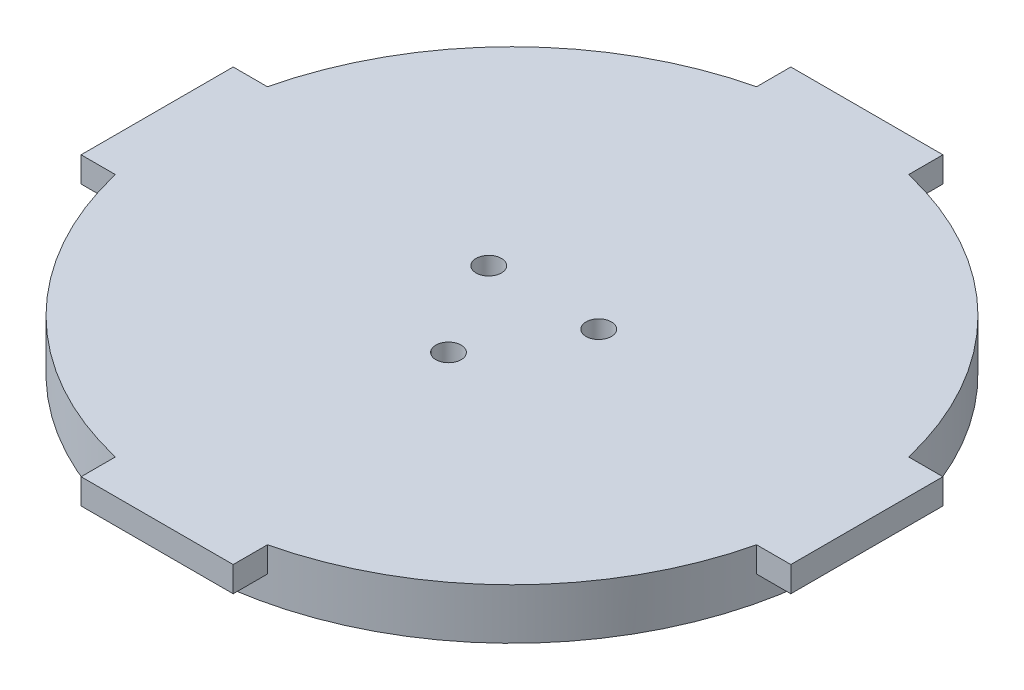
ISO-10303-21;
HEADER;
FILE_DESCRIPTION(('STEP AP214'),'2;1');
FILE_NAME('part.step','',(''),(''),'','','');
FILE_SCHEMA(('AUTOMOTIVE_DESIGN { 1 0 10303 214 1 1 1 1 }'));
ENDSEC;
DATA;
#1=APPLICATION_CONTEXT('core data for automotive mechanical design processes');
#2=APPLICATION_PROTOCOL_DEFINITION('international standard','automotive_design',2000,#1);
#3=PRODUCT_CONTEXT('',#1,'mechanical');
#4=PRODUCT('Part','Part','',(#3));
#5=PRODUCT_RELATED_PRODUCT_CATEGORY('part','',(#4));
#6=PRODUCT_DEFINITION_FORMATION('','',#4);
#7=PRODUCT_DEFINITION_CONTEXT('part definition',#1,'design');
#8=PRODUCT_DEFINITION('design','',#6,#7);
#9=PRODUCT_DEFINITION_SHAPE('','',#8);
#10=(LENGTH_UNIT() NAMED_UNIT(*) SI_UNIT(.MILLI.,.METRE.));
#11=(NAMED_UNIT(*) PLANE_ANGLE_UNIT() SI_UNIT($,.RADIAN.));
#12=(NAMED_UNIT(*) SI_UNIT($,.STERADIAN.) SOLID_ANGLE_UNIT());
#13=UNCERTAINTY_MEASURE_WITH_UNIT(LENGTH_MEASURE(1.E-05),#10,'distance_accuracy_value','');
#14=(GEOMETRIC_REPRESENTATION_CONTEXT(3) GLOBAL_UNCERTAINTY_ASSIGNED_CONTEXT((#13)) GLOBAL_UNIT_ASSIGNED_CONTEXT((#10,
#11,#12)) REPRESENTATION_CONTEXT('',''));
#15=CARTESIAN_POINT('',(0.,0.,0.));
#16=DIRECTION('',(0.,0.,1.));
#17=DIRECTION('',(1.,0.,0.));
#18=AXIS2_PLACEMENT_3D('',#15,#16,#17);
#19=CARTESIAN_POINT('',(0.,-141.847763108502,0.));
#20=DIRECTION('',(0.,1.,0.));
#21=DIRECTION('',(0.,0.,1.));
#22=AXIS2_PLACEMENT_3D('',#19,#20,#21);
#23=CYLINDRICAL_SURFACE('',#22,65.);
#24=DIRECTION('',(0.,-1.,0.));
#25=VECTOR('',#24,1.);
#26=CARTESIAN_POINT('',(-15.,70.,63.2455532033676));
#27=LINE('',#26,#25);
#28=CARTESIAN_POINT('',(-15.,70.,63.2455532033676));
#29=VERTEX_POINT('',#28);
#30=CARTESIAN_POINT('',(-15.,65.,63.2455532033676));
#31=VERTEX_POINT('',#30);
#32=EDGE_CURVE('E198',#29,#31,#27,.T.);
#33=ORIENTED_EDGE('',*,*,#32,.F.);
#34=CARTESIAN_POINT('',(0.,70.,0.));
#35=DIRECTION('',(0.,1.,0.));
#36=DIRECTION('',(0.,0.,1.));
#37=AXIS2_PLACEMENT_3D('',#34,#35,#36);
#38=CIRCLE('',#37,65.);
#39=CARTESIAN_POINT('',(-63.2455532033676,70.,15.));
#40=VERTEX_POINT('',#39);
#41=EDGE_CURVE('E213',#40,#29,#38,.T.);
#42=ORIENTED_EDGE('',*,*,#41,.F.);
#43=DIRECTION('',(0.,-1.,0.));
#44=VECTOR('',#43,1.);
#45=CARTESIAN_POINT('',(-63.2455532033676,70.,15.));
#46=LINE('',#45,#44);
#47=CARTESIAN_POINT('',(-63.2455532033676,65.,15.));
#48=VERTEX_POINT('',#47);
#49=EDGE_CURVE('E71',#40,#48,#46,.T.);
#50=ORIENTED_EDGE('',*,*,#49,.T.);
#51=CARTESIAN_POINT('',(0.,65.,0.));
#52=DIRECTION('',(0.,1.,0.));
#53=DIRECTION('',(0.,0.,1.));
#54=AXIS2_PLACEMENT_3D('',#51,#52,#53);
#55=CIRCLE('',#54,65.);
#56=CARTESIAN_POINT('',(-63.2455532033676,65.,-15.));
#57=VERTEX_POINT('',#56);
#58=EDGE_CURVE('E290',#57,#48,#55,.T.);
#59=ORIENTED_EDGE('',*,*,#58,.F.);
#60=DIRECTION('',(0.,-1.,0.));
#61=VECTOR('',#60,1.);
#62=CARTESIAN_POINT('',(-63.2455532033676,70.,-15.));
#63=LINE('',#62,#61);
#64=CARTESIAN_POINT('',(-63.2455532033676,70.,-15.));
#65=VERTEX_POINT('',#64);
#66=EDGE_CURVE('E312',#65,#57,#63,.T.);
#67=ORIENTED_EDGE('',*,*,#66,.F.);
#68=CARTESIAN_POINT('',(-15.,70.,-63.2455532033676));
#69=VERTEX_POINT('',#68);
#70=EDGE_CURVE('E225',#69,#65,#38,.T.);
#71=ORIENTED_EDGE('',*,*,#70,.F.);
#72=DIRECTION('',(0.,-1.,0.));
#73=VECTOR('',#72,1.);
#74=CARTESIAN_POINT('',(-15.,70.,-63.2455532033676));
#75=LINE('',#74,#73);
#76=CARTESIAN_POINT('',(-15.,65.,-63.2455532033676));
#77=VERTEX_POINT('',#76);
#78=EDGE_CURVE('E79',#69,#77,#75,.T.);
#79=ORIENTED_EDGE('',*,*,#78,.T.);
#80=CARTESIAN_POINT('',(0.,65.,0.));
#81=DIRECTION('',(0.,1.,0.));
#82=DIRECTION('',(0.,0.,1.));
#83=AXIS2_PLACEMENT_3D('',#80,#81,#82);
#84=CIRCLE('',#83,65.);
#85=CARTESIAN_POINT('',(15.,65.,-63.2455532033676));
#86=VERTEX_POINT('',#85);
#87=EDGE_CURVE('E263',#86,#77,#84,.T.);
#88=ORIENTED_EDGE('',*,*,#87,.F.);
#89=DIRECTION('',(0.,-1.,0.));
#90=VECTOR('',#89,1.);
#91=CARTESIAN_POINT('',(15.,70.,-63.2455532033676));
#92=LINE('',#91,#90);
#93=CARTESIAN_POINT('',(15.,70.,-63.2455532033676));
#94=VERTEX_POINT('',#93);
#95=EDGE_CURVE('E261',#94,#86,#92,.T.);
#96=ORIENTED_EDGE('',*,*,#95,.F.);
#97=CARTESIAN_POINT('',(63.2455532033676,70.,-15.));
#98=VERTEX_POINT('',#97);
#99=EDGE_CURVE('E232',#98,#94,#38,.T.);
#100=ORIENTED_EDGE('',*,*,#99,.F.);
#101=DIRECTION('',(0.,-1.,0.));
#102=VECTOR('',#101,1.);
#103=CARTESIAN_POINT('',(63.2455532033676,70.,-15.));
#104=LINE('',#103,#102);
#105=CARTESIAN_POINT('',(63.2455532033676,65.,-15.));
#106=VERTEX_POINT('',#105);
#107=EDGE_CURVE('E259',#98,#106,#104,.T.);
#108=ORIENTED_EDGE('',*,*,#107,.T.);
#109=CARTESIAN_POINT('',(0.,65.,0.));
#110=DIRECTION('',(0.,1.,0.));
#111=DIRECTION('',(0.,0.,1.));
#112=AXIS2_PLACEMENT_3D('',#109,#110,#111);
#113=CIRCLE('',#112,65.);
#114=CARTESIAN_POINT('',(63.2455532033676,65.,15.));
#115=VERTEX_POINT('',#114);
#116=EDGE_CURVE('E279',#115,#106,#113,.T.);
#117=ORIENTED_EDGE('',*,*,#116,.F.);
#118=DIRECTION('',(0.,-1.,0.));
#119=VECTOR('',#118,1.);
#120=CARTESIAN_POINT('',(63.2455532033676,70.,15.));
#121=LINE('',#120,#119);
#122=CARTESIAN_POINT('',(63.2455532033676,70.,15.));
#123=VERTEX_POINT('',#122);
#124=EDGE_CURVE('E522',#123,#115,#121,.T.);
#125=ORIENTED_EDGE('',*,*,#124,.F.);
#126=CARTESIAN_POINT('',(15.,70.,63.2455532033676));
#127=VERTEX_POINT('',#126);
#128=EDGE_CURVE('E228',#127,#123,#38,.T.);
#129=ORIENTED_EDGE('',*,*,#128,.F.);
#130=DIRECTION('',(0.,-1.,0.));
#131=VECTOR('',#130,1.);
#132=CARTESIAN_POINT('',(15.,70.,63.2455532033676));
#133=LINE('',#132,#131);
#134=CARTESIAN_POINT('',(15.,65.,63.2455532033676));
#135=VERTEX_POINT('',#134);
#136=EDGE_CURVE('E524',#127,#135,#133,.T.);
#137=ORIENTED_EDGE('',*,*,#136,.T.);
#138=CARTESIAN_POINT('',(0.,65.,0.));
#139=DIRECTION('',(0.,1.,0.));
#140=DIRECTION('',(0.,0.,1.));
#141=AXIS2_PLACEMENT_3D('',#138,#139,#140);
#142=CIRCLE('',#141,65.);
#143=EDGE_CURVE('E216',#31,#135,#142,.T.);
#144=ORIENTED_EDGE('',*,*,#143,.F.);
#145=EDGE_LOOP('',(#33,#42,#50,#59,#67,#71,#79,#88,#96,#100,#108,#117,#125,#129,#137,#144));
#146=FACE_BOUND('',#145,.T.);
#147=CARTESIAN_POINT('',(0.,60.,0.));
#148=DIRECTION('',(0.,1.,0.));
#149=DIRECTION('',(0.,0.,1.));
#150=AXIS2_PLACEMENT_3D('',#147,#148,#149);
#151=CIRCLE('',#150,65.);
#152=CARTESIAN_POINT('',(0.,60.,65.));
#153=VERTEX_POINT('',#152);
#154=EDGE_CURVE('E226',#153,#153,#151,.T.);
#155=ORIENTED_EDGE('',*,*,#154,.T.);
#156=EDGE_LOOP('',(#155));
#157=FACE_BOUND('',#156,.T.);
#158=ADVANCED_FACE('F55',(#146,#157),#23,.T.);
#159=CARTESIAN_POINT('',(0.,70.,0.));
#160=DIRECTION('',(0.,1.,0.));
#161=DIRECTION('',(0.,0.,1.));
#162=AXIS2_PLACEMENT_3D('',#159,#160,#161);
#163=PLANE('',#162);
#164=CARTESIAN_POINT('',(0.,70.,12.525));
#165=DIRECTION('',(0.,-1.,0.));
#166=DIRECTION('',(-0.866025403784436,0.,0.500000000000004));
#167=AXIS2_PLACEMENT_3D('',#164,#165,#166);
#168=CIRCLE('',#167,2.5);
#169=CARTESIAN_POINT('',(0.,70.,10.025));
#170=VERTEX_POINT('',#169);
#171=EDGE_CURVE('E316',#170,#170,#168,.T.);
#172=ORIENTED_EDGE('',*,*,#171,.T.);
#173=EDGE_LOOP('',(#172));
#174=FACE_BOUND('',#173,.T.);
#175=CARTESIAN_POINT('',(10.8469681824001,70.,-6.26250000000005));
#176=DIRECTION('',(0.,-1.,0.));
#177=DIRECTION('',(0.866025403784443,0.,0.499999999999992));
#178=AXIS2_PLACEMENT_3D('',#175,#176,#177);
#179=CIRCLE('',#178,2.5);
#180=CARTESIAN_POINT('',(10.8469681824001,70.,-8.76250000000005));
#181=VERTEX_POINT('',#180);
#182=EDGE_CURVE('E218',#181,#181,#179,.T.);
#183=ORIENTED_EDGE('',*,*,#182,.T.);
#184=EDGE_LOOP('',(#183));
#185=FACE_BOUND('',#184,.T.);
#186=CARTESIAN_POINT('',(-10.8469681824001,70.,-6.26250000000005));
#187=DIRECTION('',(0.,-1.,0.));
#188=DIRECTION('',(0.,0.,-1.));
#189=AXIS2_PLACEMENT_3D('',#186,#187,#188);
#190=CIRCLE('',#189,2.5);
#191=CARTESIAN_POINT('',(-10.8469681824001,70.,-8.76250000000004));
#192=VERTEX_POINT('',#191);
#193=EDGE_CURVE('E331',#192,#192,#190,.T.);
#194=ORIENTED_EDGE('',*,*,#193,.T.);
#195=EDGE_LOOP('',(#194));
#196=FACE_BOUND('',#195,.T.);
#197=ORIENTED_EDGE('',*,*,#128,.T.);
#198=DIRECTION('',(-1.,0.,0.));
#199=VECTOR('',#198,1.);
#200=CARTESIAN_POINT('',(0.,70.,15.));
#201=LINE('',#200,#199);
#202=CARTESIAN_POINT('',(70.,70.,15.));
#203=VERTEX_POINT('',#202);
#204=EDGE_CURVE('E540',#203,#123,#201,.T.);
#205=ORIENTED_EDGE('',*,*,#204,.F.);
#206=DIRECTION('',(0.,0.,1.));
#207=VECTOR('',#206,1.);
#208=CARTESIAN_POINT('',(70.,70.,0.));
#209=LINE('',#208,#207);
#210=CARTESIAN_POINT('',(70.,70.,-15.));
#211=VERTEX_POINT('',#210);
#212=EDGE_CURVE('E543',#211,#203,#209,.T.);
#213=ORIENTED_EDGE('',*,*,#212,.F.);
#214=DIRECTION('',(-1.,0.,0.));
#215=VECTOR('',#214,1.);
#216=CARTESIAN_POINT('',(0.,70.,-15.));
#217=LINE('',#216,#215);
#218=EDGE_CURVE('E255',#211,#98,#217,.T.);
#219=ORIENTED_EDGE('',*,*,#218,.T.);
#220=ORIENTED_EDGE('',*,*,#99,.T.);
#221=DIRECTION('',(0.,0.,1.));
#222=VECTOR('',#221,1.);
#223=CARTESIAN_POINT('',(15.,70.,0.));
#224=LINE('',#223,#222);
#225=CARTESIAN_POINT('',(15.,70.,-70.));
#226=VERTEX_POINT('',#225);
#227=EDGE_CURVE('E252',#226,#94,#224,.T.);
#228=ORIENTED_EDGE('',*,*,#227,.F.);
#229=DIRECTION('',(1.,0.,0.));
#230=VECTOR('',#229,1.);
#231=CARTESIAN_POINT('',(0.,70.,-70.));
#232=LINE('',#231,#230);
#233=CARTESIAN_POINT('',(-15.,70.,-70.));
#234=VERTEX_POINT('',#233);
#235=EDGE_CURVE('E573',#234,#226,#232,.T.);
#236=ORIENTED_EDGE('',*,*,#235,.F.);
#237=DIRECTION('',(0.,0.,1.));
#238=VECTOR('',#237,1.);
#239=CARTESIAN_POINT('',(-15.,70.,0.));
#240=LINE('',#239,#238);
#241=EDGE_CURVE('E577',#234,#69,#240,.T.);
#242=ORIENTED_EDGE('',*,*,#241,.T.);
#243=ORIENTED_EDGE('',*,*,#70,.T.);
#244=DIRECTION('',(1.,0.,0.));
#245=VECTOR('',#244,1.);
#246=CARTESIAN_POINT('',(0.,70.,-15.));
#247=LINE('',#246,#245);
#248=CARTESIAN_POINT('',(-70.,70.,-15.));
#249=VERTEX_POINT('',#248);
#250=EDGE_CURVE('E280',#249,#65,#247,.T.);
#251=ORIENTED_EDGE('',*,*,#250,.F.);
#252=DIRECTION('',(0.,0.,-1.));
#253=VECTOR('',#252,1.);
#254=CARTESIAN_POINT('',(-70.,70.,0.));
#255=LINE('',#254,#253);
#256=CARTESIAN_POINT('',(-70.,70.,15.));
#257=VERTEX_POINT('',#256);
#258=EDGE_CURVE('E283',#257,#249,#255,.T.);
#259=ORIENTED_EDGE('',*,*,#258,.F.);
#260=DIRECTION('',(1.,0.,0.));
#261=VECTOR('',#260,1.);
#262=CARTESIAN_POINT('',(0.,70.,15.));
#263=LINE('',#262,#261);
#264=EDGE_CURVE('E223',#257,#40,#263,.T.);
#265=ORIENTED_EDGE('',*,*,#264,.T.);
#266=ORIENTED_EDGE('',*,*,#41,.T.);
#267=DIRECTION('',(0.,0.,-1.));
#268=VECTOR('',#267,1.);
#269=CARTESIAN_POINT('',(-15.,70.,0.));
#270=LINE('',#269,#268);
#271=CARTESIAN_POINT('',(-15.,70.,70.));
#272=VERTEX_POINT('',#271);
#273=EDGE_CURVE('E194',#272,#29,#270,.T.);
#274=ORIENTED_EDGE('',*,*,#273,.F.);
#275=DIRECTION('',(-1.,0.,0.));
#276=VECTOR('',#275,1.);
#277=CARTESIAN_POINT('',(0.,70.,70.));
#278=LINE('',#277,#276);
#279=CARTESIAN_POINT('',(15.,70.,70.));
#280=VERTEX_POINT('',#279);
#281=EDGE_CURVE('E206',#280,#272,#278,.T.);
#282=ORIENTED_EDGE('',*,*,#281,.F.);
#283=DIRECTION('',(0.,0.,-1.));
#284=VECTOR('',#283,1.);
#285=CARTESIAN_POINT('',(15.,70.,0.));
#286=LINE('',#285,#284);
#287=EDGE_CURVE('E529',#280,#127,#286,.T.);
#288=ORIENTED_EDGE('',*,*,#287,.T.);
#289=EDGE_LOOP('',(#197,#205,#213,#219,#220,#228,#236,#242,#243,#251,#259,#265,#266,#274,#282,#288));
#290=FACE_BOUND('',#289,.T.);
#291=ADVANCED_FACE('F221',(#174,#185,#196,#290),#163,.T.);
#292=CARTESIAN_POINT('',(0.,45.,0.));
#293=DIRECTION('',(0.,1.,0.));
#294=DIRECTION('',(0.,0.,1.));
#295=AXIS2_PLACEMENT_3D('',#292,#293,#294);
#296=PLANE('',#295);
#297=CARTESIAN_POINT('',(-10.8469681824001,45.,-6.26250000000005));
#298=DIRECTION('',(0.,1.,0.));
#299=DIRECTION('',(0.,0.,1.));
#300=AXIS2_PLACEMENT_3D('',#297,#298,#299);
#301=CIRCLE('',#300,2.5);
#302=CARTESIAN_POINT('',(-10.8469681824001,45.,-8.76250000000004));
#303=VERTEX_POINT('',#302);
#304=EDGE_CURVE('E234',#303,#303,#301,.T.);
#305=ORIENTED_EDGE('',*,*,#304,.T.);
#306=EDGE_LOOP('',(#305));
#307=FACE_BOUND('',#306,.T.);
#308=CARTESIAN_POINT('',(0.,45.,0.));
#309=DIRECTION('',(0.,1.,0.));
#310=DIRECTION('',(0.,0.,1.));
#311=AXIS2_PLACEMENT_3D('',#308,#309,#310);
#312=CIRCLE('',#311,6.);
#313=CARTESIAN_POINT('',(-2.,45.,-5.65685424949238));
#314=VERTEX_POINT('',#313);
#315=CARTESIAN_POINT('',(2.,45.,-5.65685424949238));
#316=VERTEX_POINT('',#315);
#317=EDGE_CURVE('E238',#314,#316,#312,.T.);
#318=ORIENTED_EDGE('',*,*,#317,.T.);
#319=DIRECTION('',(0.,0.,1.));
#320=VECTOR('',#319,1.);
#321=CARTESIAN_POINT('',(2.,45.,0.));
#322=LINE('',#321,#320);
#323=CARTESIAN_POINT('',(2.,45.,-8.));
#324=VERTEX_POINT('',#323);
#325=EDGE_CURVE('E407',#324,#316,#322,.T.);
#326=ORIENTED_EDGE('',*,*,#325,.F.);
#327=DIRECTION('',(1.,0.,0.));
#328=VECTOR('',#327,1.);
#329=CARTESIAN_POINT('',(0.,45.,-8.));
#330=LINE('',#329,#328);
#331=CARTESIAN_POINT('',(-2.,45.,-8.));
#332=VERTEX_POINT('',#331);
#333=EDGE_CURVE('E410',#332,#324,#330,.T.);
#334=ORIENTED_EDGE('',*,*,#333,.F.);
#335=DIRECTION('',(0.,0.,1.));
#336=VECTOR('',#335,1.);
#337=CARTESIAN_POINT('',(-2.,45.,0.));
#338=LINE('',#337,#336);
#339=EDGE_CURVE('E245',#332,#314,#338,.T.);
#340=ORIENTED_EDGE('',*,*,#339,.T.);
#341=EDGE_LOOP('',(#318,#326,#334,#340));
#342=FACE_BOUND('',#341,.T.);
#343=CARTESIAN_POINT('',(0.,45.,0.));
#344=DIRECTION('',(0.,1.,0.));
#345=DIRECTION('',(0.,0.,1.));
#346=AXIS2_PLACEMENT_3D('',#343,#344,#345);
#347=CIRCLE('',#346,19.05);
#348=CARTESIAN_POINT('',(0.,45.,19.05));
#349=VERTEX_POINT('',#348);
#350=EDGE_CURVE('E413',#349,#349,#347,.T.);
#351=ORIENTED_EDGE('',*,*,#350,.F.);
#352=EDGE_LOOP('',(#351));
#353=FACE_BOUND('',#352,.T.);
#354=CARTESIAN_POINT('',(0.,45.,12.525));
#355=DIRECTION('',(0.,1.,0.));
#356=DIRECTION('',(0.,0.,1.));
#357=AXIS2_PLACEMENT_3D('',#354,#355,#356);
#358=CIRCLE('',#357,2.5);
#359=CARTESIAN_POINT('',(0.,45.,10.025));
#360=VERTEX_POINT('',#359);
#361=EDGE_CURVE('E327',#360,#360,#358,.T.);
#362=ORIENTED_EDGE('',*,*,#361,.T.);
#363=EDGE_LOOP('',(#362));
#364=FACE_BOUND('',#363,.T.);
#365=CARTESIAN_POINT('',(10.8469681824001,45.,-6.26250000000005));
#366=DIRECTION('',(0.,1.,0.));
#367=DIRECTION('',(0.,0.,1.));
#368=AXIS2_PLACEMENT_3D('',#365,#366,#367);
#369=CIRCLE('',#368,2.5);
#370=CARTESIAN_POINT('',(10.8469681824001,45.,-8.76250000000005));
#371=VERTEX_POINT('',#370);
#372=EDGE_CURVE('E320',#371,#371,#369,.T.);
#373=ORIENTED_EDGE('',*,*,#372,.T.);
#374=EDGE_LOOP('',(#373));
#375=FACE_BOUND('',#374,.T.);
#376=ADVANCED_FACE('F338',(#307,#342,#353,#364,#375),#296,.F.);
#377=CARTESIAN_POINT('',(2.,42.,0.));
#378=DIRECTION('',(-1.,0.,0.));
#379=DIRECTION('',(0.,0.,1.));
#380=AXIS2_PLACEMENT_3D('',#377,#378,#379);
#381=PLANE('',#380);
#382=DIRECTION('',(0.,1.,0.));
#383=VECTOR('',#382,1.);
#384=CARTESIAN_POINT('',(2.,42.,-8.));
#385=LINE('',#384,#383);
#386=CARTESIAN_POINT('',(2.,42.,-8.));
#387=VERTEX_POINT('',#386);
#388=EDGE_CURVE('E403',#387,#324,#385,.T.);
#389=ORIENTED_EDGE('',*,*,#388,.T.);
#390=ORIENTED_EDGE('',*,*,#325,.T.);
#391=DIRECTION('',(0.,1.,0.));
#392=VECTOR('',#391,1.);
#393=CARTESIAN_POINT('',(2.,42.,-5.65685424949238));
#394=LINE('',#393,#392);
#395=CARTESIAN_POINT('',(2.,42.,-5.65685424949238));
#396=VERTEX_POINT('',#395);
#397=EDGE_CURVE('E418',#396,#316,#394,.T.);
#398=ORIENTED_EDGE('',*,*,#397,.F.);
#399=DIRECTION('',(0.,0.,1.));
#400=VECTOR('',#399,1.);
#401=CARTESIAN_POINT('',(2.,42.,0.));
#402=LINE('',#401,#400);
#403=EDGE_CURVE('E11',#387,#396,#402,.T.);
#404=ORIENTED_EDGE('',*,*,#403,.F.);
#405=EDGE_LOOP('',(#389,#390,#398,#404));
#406=FACE_BOUND('',#405,.T.);
#407=ADVANCED_FACE('F369',(#406),#381,.F.);
#408=CARTESIAN_POINT('',(0.,42.,-8.));
#409=DIRECTION('',(0.,0.,1.));
#410=DIRECTION('',(1.,0.,0.));
#411=AXIS2_PLACEMENT_3D('',#408,#409,#410);
#412=PLANE('',#411);
#413=DIRECTION('',(0.,1.,0.));
#414=VECTOR('',#413,1.);
#415=CARTESIAN_POINT('',(-2.,42.,-8.));
#416=LINE('',#415,#414);
#417=CARTESIAN_POINT('',(-2.,42.,-8.));
#418=VERTEX_POINT('',#417);
#419=EDGE_CURVE('E398',#418,#332,#416,.T.);
#420=ORIENTED_EDGE('',*,*,#419,.T.);
#421=ORIENTED_EDGE('',*,*,#333,.T.);
#422=ORIENTED_EDGE('',*,*,#388,.F.);
#423=DIRECTION('',(1.,0.,0.));
#424=VECTOR('',#423,1.);
#425=CARTESIAN_POINT('',(0.,42.,-8.));
#426=LINE('',#425,#424);
#427=EDGE_CURVE('E64',#418,#387,#426,.T.);
#428=ORIENTED_EDGE('',*,*,#427,.F.);
#429=EDGE_LOOP('',(#420,#421,#422,#428));
#430=FACE_BOUND('',#429,.T.);
#431=ADVANCED_FACE('F386',(#430),#412,.F.);
#432=CARTESIAN_POINT('',(-2.,42.,0.));
#433=DIRECTION('',(-1.,0.,0.));
#434=DIRECTION('',(0.,0.,1.));
#435=AXIS2_PLACEMENT_3D('',#432,#433,#434);
#436=PLANE('',#435);
#437=ORIENTED_EDGE('',*,*,#339,.F.);
#438=ORIENTED_EDGE('',*,*,#419,.F.);
#439=DIRECTION('',(0.,0.,1.));
#440=VECTOR('',#439,1.);
#441=CARTESIAN_POINT('',(-2.,42.,0.));
#442=LINE('',#441,#440);
#443=CARTESIAN_POINT('',(-2.,42.,-5.65685424949238));
#444=VERTEX_POINT('',#443);
#445=EDGE_CURVE('E425',#418,#444,#442,.T.);
#446=ORIENTED_EDGE('',*,*,#445,.T.);
#447=DIRECTION('',(0.,1.,0.));
#448=VECTOR('',#447,1.);
#449=CARTESIAN_POINT('',(-2.,42.,-5.65685424949238));
#450=LINE('',#449,#448);
#451=EDGE_CURVE('E400',#444,#314,#450,.T.);
#452=ORIENTED_EDGE('',*,*,#451,.T.);
#453=EDGE_LOOP('',(#437,#438,#446,#452));
#454=FACE_BOUND('',#453,.T.);
#455=ADVANCED_FACE('F382',(#454),#436,.T.);
#456=CARTESIAN_POINT('',(0.,42.,0.));
#457=DIRECTION('',(0.,1.,0.));
#458=DIRECTION('',(0.,0.,1.));
#459=AXIS2_PLACEMENT_3D('',#456,#457,#458);
#460=CYLINDRICAL_SURFACE('',#459,6.);
#461=ORIENTED_EDGE('',*,*,#317,.F.);
#462=ORIENTED_EDGE('',*,*,#451,.F.);
#463=CARTESIAN_POINT('',(0.,42.,0.));
#464=DIRECTION('',(0.,1.,0.));
#465=DIRECTION('',(0.,0.,1.));
#466=AXIS2_PLACEMENT_3D('',#463,#464,#465);
#467=CIRCLE('',#466,6.);
#468=EDGE_CURVE('E58',#444,#396,#467,.T.);
#469=ORIENTED_EDGE('',*,*,#468,.T.);
#470=ORIENTED_EDGE('',*,*,#397,.T.);
#471=EDGE_LOOP('',(#461,#462,#469,#470));
#472=FACE_BOUND('',#471,.T.);
#473=ADVANCED_FACE('F377',(#472),#460,.T.);
#474=CARTESIAN_POINT('',(0.,45.,0.));
#475=DIRECTION('',(0.,1.,0.));
#476=DIRECTION('',(0.,0.,1.));
#477=AXIS2_PLACEMENT_3D('',#474,#475,#476);
#478=CYLINDRICAL_SURFACE('',#477,19.05);
#479=ORIENTED_EDGE('',*,*,#350,.T.);
#480=EDGE_LOOP('',(#479));
#481=FACE_BOUND('',#480,.T.);
#482=CARTESIAN_POINT('',(0.,60.,0.));
#483=DIRECTION('',(0.,1.,0.));
#484=DIRECTION('',(0.,0.,1.));
#485=AXIS2_PLACEMENT_3D('',#482,#483,#484);
#486=CIRCLE('',#485,19.05);
#487=CARTESIAN_POINT('',(0.,60.,19.05));
#488=VERTEX_POINT('',#487);
#489=EDGE_CURVE('E417',#488,#488,#486,.T.);
#490=ORIENTED_EDGE('',*,*,#489,.F.);
#491=EDGE_LOOP('',(#490));
#492=FACE_BOUND('',#491,.T.);
#493=ADVANCED_FACE('F374',(#481,#492),#478,.T.);
#494=CARTESIAN_POINT('',(0.,60.,0.));
#495=DIRECTION('',(0.,1.,0.));
#496=DIRECTION('',(0.,0.,1.));
#497=AXIS2_PLACEMENT_3D('',#494,#495,#496);
#498=PLANE('',#497);
#499=ORIENTED_EDGE('',*,*,#154,.F.);
#500=EDGE_LOOP('',(#499));
#501=FACE_BOUND('',#500,.T.);
#502=ORIENTED_EDGE('',*,*,#489,.T.);
#503=EDGE_LOOP('',(#502));
#504=FACE_BOUND('',#503,.T.);
#505=ADVANCED_FACE('F355',(#501,#504),#498,.F.);
#506=CARTESIAN_POINT('',(0.,42.,0.));
#507=DIRECTION('',(0.,1.,0.));
#508=DIRECTION('',(0.,0.,1.));
#509=AXIS2_PLACEMENT_3D('',#506,#507,#508);
#510=PLANE('',#509);
#511=ORIENTED_EDGE('',*,*,#468,.F.);
#512=ORIENTED_EDGE('',*,*,#445,.F.);
#513=ORIENTED_EDGE('',*,*,#427,.T.);
#514=ORIENTED_EDGE('',*,*,#403,.T.);
#515=EDGE_LOOP('',(#511,#512,#513,#514));
#516=FACE_BOUND('',#515,.T.);
#517=ADVANCED_FACE('F344',(#516),#510,.F.);
#518=CARTESIAN_POINT('',(-10.8469681824001,70.,-6.26250000000005));
#519=DIRECTION('',(0.,-1.,0.));
#520=DIRECTION('',(0.,0.,-1.));
#521=AXIS2_PLACEMENT_3D('',#518,#519,#520);
#522=CYLINDRICAL_SURFACE('',#521,2.5);
#523=CARTESIAN_POINT('',(-10.8469681824001,70.,-8.76250000000004));
#524=CARTESIAN_POINT('',(-10.8469681824001,69.7395833333333,-8.76250000000004));
#525=CARTESIAN_POINT('',(-10.8469681824001,69.4791666666667,-8.76250000000004));
#526=CARTESIAN_POINT('',(-10.8469681824001,68.9583333333333,-8.76250000000004));
#527=CARTESIAN_POINT('',(-10.8469681824001,68.6979166666667,-8.76250000000004));
#528=CARTESIAN_POINT('',(-10.8469681824001,68.1770833333333,-8.76250000000004));
#529=CARTESIAN_POINT('',(-10.8469681824001,67.9166666666667,-8.76250000000004));
#530=CARTESIAN_POINT('',(-10.8469681824001,67.3958333333333,-8.76250000000004));
#531=CARTESIAN_POINT('',(-10.8469681824001,67.1354166666667,-8.76250000000004));
#532=CARTESIAN_POINT('',(-10.8469681824001,66.6145833333333,-8.76250000000004));
#533=CARTESIAN_POINT('',(-10.8469681824001,66.3541666666667,-8.76250000000004));
#534=CARTESIAN_POINT('',(-10.8469681824001,65.8333333333333,-8.76250000000004));
#535=CARTESIAN_POINT('',(-10.8469681824001,65.5729166666667,-8.76250000000004));
#536=CARTESIAN_POINT('',(-10.8469681824001,65.0520833333333,-8.76250000000004));
#537=CARTESIAN_POINT('',(-10.8469681824001,64.7916666666667,-8.76250000000004));
#538=CARTESIAN_POINT('',(-10.8469681824001,64.2708333333333,-8.76250000000004));
#539=CARTESIAN_POINT('',(-10.8469681824001,64.0104166666667,-8.76250000000004));
#540=CARTESIAN_POINT('',(-10.8469681824001,63.4895833333333,-8.76250000000004));
#541=CARTESIAN_POINT('',(-10.8469681824001,63.2291666666667,-8.76250000000004));
#542=CARTESIAN_POINT('',(-10.8469681824001,62.7083333333333,-8.76250000000004));
#543=CARTESIAN_POINT('',(-10.8469681824001,62.4479166666667,-8.76250000000004));
#544=CARTESIAN_POINT('',(-10.8469681824001,61.9270833333333,-8.76250000000004));
#545=CARTESIAN_POINT('',(-10.8469681824001,61.6666666666667,-8.76250000000004));
#546=CARTESIAN_POINT('',(-10.8469681824001,61.1458333333333,-8.76250000000004));
#547=CARTESIAN_POINT('',(-10.8469681824001,60.8854166666667,-8.76250000000004));
#548=CARTESIAN_POINT('',(-10.8469681824001,60.3645833333333,-8.76250000000004));
#549=CARTESIAN_POINT('',(-10.8469681824001,60.1041666666667,-8.76250000000004));
#550=CARTESIAN_POINT('',(-10.8469681824001,59.5833333333333,-8.76250000000004));
#551=CARTESIAN_POINT('',(-10.8469681824001,59.3229166666667,-8.76250000000004));
#552=CARTESIAN_POINT('',(-10.8469681824001,58.8020833333333,-8.76250000000004));
#553=CARTESIAN_POINT('',(-10.8469681824001,58.5416666666667,-8.76250000000004));
#554=CARTESIAN_POINT('',(-10.8469681824001,58.0208333333333,-8.76250000000004));
#555=CARTESIAN_POINT('',(-10.8469681824001,57.7604166666667,-8.76250000000004));
#556=CARTESIAN_POINT('',(-10.8469681824001,57.2395833333333,-8.76250000000004));
#557=CARTESIAN_POINT('',(-10.8469681824001,56.9791666666667,-8.76250000000004));
#558=CARTESIAN_POINT('',(-10.8469681824001,56.4583333333333,-8.76250000000004));
#559=CARTESIAN_POINT('',(-10.8469681824001,56.1979166666667,-8.76250000000004));
#560=CARTESIAN_POINT('',(-10.8469681824001,55.6770833333333,-8.76250000000004));
#561=CARTESIAN_POINT('',(-10.8469681824001,55.4166666666667,-8.76250000000004));
#562=CARTESIAN_POINT('',(-10.8469681824001,54.8958333333333,-8.76250000000004));
#563=CARTESIAN_POINT('',(-10.8469681824001,54.6354166666667,-8.76250000000004));
#564=CARTESIAN_POINT('',(-10.8469681824001,54.1145833333333,-8.76250000000004));
#565=CARTESIAN_POINT('',(-10.8469681824001,53.8541666666667,-8.76250000000004));
#566=CARTESIAN_POINT('',(-10.8469681824001,53.3333333333333,-8.76250000000004));
#567=CARTESIAN_POINT('',(-10.8469681824001,53.0729166666667,-8.76250000000004));
#568=CARTESIAN_POINT('',(-10.8469681824001,52.5520833333333,-8.76250000000004));
#569=CARTESIAN_POINT('',(-10.8469681824001,52.2916666666667,-8.76250000000004));
#570=CARTESIAN_POINT('',(-10.8469681824001,51.7708333333333,-8.76250000000004));
#571=CARTESIAN_POINT('',(-10.8469681824001,51.5104166666667,-8.76250000000004));
#572=CARTESIAN_POINT('',(-10.8469681824001,50.9895833333333,-8.76250000000004));
#573=CARTESIAN_POINT('',(-10.8469681824001,50.7291666666667,-8.76250000000004));
#574=CARTESIAN_POINT('',(-10.8469681824001,50.2083333333333,-8.76250000000004));
#575=CARTESIAN_POINT('',(-10.8469681824001,49.9479166666667,-8.76250000000004));
#576=CARTESIAN_POINT('',(-10.8469681824001,49.4270833333333,-8.76250000000004));
#577=CARTESIAN_POINT('',(-10.8469681824001,49.1666666666667,-8.76250000000004));
#578=CARTESIAN_POINT('',(-10.8469681824001,48.6458333333333,-8.76250000000004));
#579=CARTESIAN_POINT('',(-10.8469681824001,48.3854166666667,-8.76250000000004));
#580=CARTESIAN_POINT('',(-10.8469681824001,47.8645833333333,-8.76250000000004));
#581=CARTESIAN_POINT('',(-10.8469681824001,47.6041666666667,-8.76250000000004));
#582=CARTESIAN_POINT('',(-10.8469681824001,47.0833333333333,-8.76250000000004));
#583=CARTESIAN_POINT('',(-10.8469681824001,46.8229166666667,-8.76250000000004));
#584=CARTESIAN_POINT('',(-10.8469681824001,46.3020833333333,-8.76250000000004));
#585=CARTESIAN_POINT('',(-10.8469681824001,46.0416666666667,-8.76250000000004));
#586=CARTESIAN_POINT('',(-10.8469681824001,45.5208333333333,-8.76250000000004));
#587=CARTESIAN_POINT('',(-10.8469681824001,45.2604166666667,-8.76250000000004));
#588=CARTESIAN_POINT('',(-10.8469681824001,45.,-8.76250000000004));
#589=B_SPLINE_CURVE_WITH_KNOTS('',3,(#523,#524,#525,#526,#527,#528,#529,#530,#531,#532,#533,
#534,#535,#536,#537,#538,#539,#540,#541,#542,#543,#544,#545,#546,#547,#548,#549,#550,#551,#552,
#553,#554,#555,#556,#557,#558,#559,#560,#561,#562,#563,#564,#565,#566,#567,#568,#569,#570,#571,
#572,#573,#574,#575,#576,#577,#578,#579,#580,#581,#582,#583,#584,#585,#586,#587,#588),
.UNSPECIFIED.,.F.,.F.,(4,2,2,2,2,2,2,2,2,2,2,2,2,2,2,2,2,2,2,2,2,2,2,2,2,2,2,2,2,2,2,2,4),(0.,
0.781250000000011,1.56250000000001,2.34375000000001,3.125,3.90625000000001,4.68750000000001,
5.46875000000001,6.25000000000001,7.03125,7.81250000000001,8.59375000000001,9.37500000000001,
10.15625,10.9375,11.71875,12.5,13.28125,14.0625,14.84375,15.625,16.40625,17.1875,17.96875,18.75,
19.53125,20.3125,21.09375,21.875,22.65625,23.4375,24.21875,25.),.UNSPECIFIED.);
#590=EDGE_CURVE('BSEAM341',#192,#303,#589,.T.);
#591=ORIENTED_EDGE('',*,*,#193,.F.);
#592=ORIENTED_EDGE('',*,*,#304,.F.);
#593=ORIENTED_EDGE('',*,*,#590,.T.);
#594=ORIENTED_EDGE('',*,*,#590,.F.);
#595=EDGE_LOOP('',(#591,#593,#592,#594));
#596=FACE_BOUND('',#595,.T.);
#597=ADVANCED_FACE('F341',(#596),#522,.F.);
#598=CARTESIAN_POINT('',(10.8469681824001,70.,-6.26250000000005));
#599=DIRECTION('',(0.,-1.,0.));
#600=DIRECTION('',(0.,0.,-1.));
#601=AXIS2_PLACEMENT_3D('',#598,#599,#600);
#602=CYLINDRICAL_SURFACE('',#601,2.5);
#603=CARTESIAN_POINT('',(10.8469681824001,70.,-8.76250000000005));
#604=CARTESIAN_POINT('',(10.8469681824001,69.7395833333333,-8.76250000000005));
#605=CARTESIAN_POINT('',(10.8469681824001,69.4791666666667,-8.76250000000005));
#606=CARTESIAN_POINT('',(10.8469681824001,68.9583333333333,-8.76250000000005));
#607=CARTESIAN_POINT('',(10.8469681824001,68.6979166666667,-8.76250000000005));
#608=CARTESIAN_POINT('',(10.8469681824001,68.1770833333333,-8.76250000000005));
#609=CARTESIAN_POINT('',(10.8469681824001,67.9166666666667,-8.76250000000005));
#610=CARTESIAN_POINT('',(10.8469681824001,67.3958333333333,-8.76250000000005));
#611=CARTESIAN_POINT('',(10.8469681824001,67.1354166666667,-8.76250000000005));
#612=CARTESIAN_POINT('',(10.8469681824001,66.6145833333333,-8.76250000000005));
#613=CARTESIAN_POINT('',(10.8469681824001,66.3541666666667,-8.76250000000005));
#614=CARTESIAN_POINT('',(10.8469681824001,65.8333333333333,-8.76250000000005));
#615=CARTESIAN_POINT('',(10.8469681824001,65.5729166666667,-8.76250000000005));
#616=CARTESIAN_POINT('',(10.8469681824001,65.0520833333333,-8.76250000000005));
#617=CARTESIAN_POINT('',(10.8469681824001,64.7916666666667,-8.76250000000005));
#618=CARTESIAN_POINT('',(10.8469681824001,64.2708333333333,-8.76250000000005));
#619=CARTESIAN_POINT('',(10.8469681824001,64.0104166666667,-8.76250000000005));
#620=CARTESIAN_POINT('',(10.8469681824001,63.4895833333333,-8.76250000000005));
#621=CARTESIAN_POINT('',(10.8469681824001,63.2291666666667,-8.76250000000005));
#622=CARTESIAN_POINT('',(10.8469681824001,62.7083333333333,-8.76250000000005));
#623=CARTESIAN_POINT('',(10.8469681824001,62.4479166666667,-8.76250000000005));
#624=CARTESIAN_POINT('',(10.8469681824001,61.9270833333333,-8.76250000000005));
#625=CARTESIAN_POINT('',(10.8469681824001,61.6666666666667,-8.76250000000005));
#626=CARTESIAN_POINT('',(10.8469681824001,61.1458333333333,-8.76250000000005));
#627=CARTESIAN_POINT('',(10.8469681824001,60.8854166666667,-8.76250000000005));
#628=CARTESIAN_POINT('',(10.8469681824001,60.3645833333333,-8.76250000000005));
#629=CARTESIAN_POINT('',(10.8469681824001,60.1041666666667,-8.76250000000005));
#630=CARTESIAN_POINT('',(10.8469681824001,59.5833333333333,-8.76250000000005));
#631=CARTESIAN_POINT('',(10.8469681824001,59.3229166666667,-8.76250000000005));
#632=CARTESIAN_POINT('',(10.8469681824001,58.8020833333333,-8.76250000000005));
#633=CARTESIAN_POINT('',(10.8469681824001,58.5416666666667,-8.76250000000005));
#634=CARTESIAN_POINT('',(10.8469681824001,58.0208333333333,-8.76250000000005));
#635=CARTESIAN_POINT('',(10.8469681824001,57.7604166666667,-8.76250000000005));
#636=CARTESIAN_POINT('',(10.8469681824001,57.2395833333333,-8.76250000000005));
#637=CARTESIAN_POINT('',(10.8469681824001,56.9791666666667,-8.76250000000005));
#638=CARTESIAN_POINT('',(10.8469681824001,56.4583333333333,-8.76250000000005));
#639=CARTESIAN_POINT('',(10.8469681824001,56.1979166666667,-8.76250000000005));
#640=CARTESIAN_POINT('',(10.8469681824001,55.6770833333333,-8.76250000000005));
#641=CARTESIAN_POINT('',(10.8469681824001,55.4166666666667,-8.76250000000005));
#642=CARTESIAN_POINT('',(10.8469681824001,54.8958333333333,-8.76250000000005));
#643=CARTESIAN_POINT('',(10.8469681824001,54.6354166666667,-8.76250000000005));
#644=CARTESIAN_POINT('',(10.8469681824001,54.1145833333333,-8.76250000000005));
#645=CARTESIAN_POINT('',(10.8469681824001,53.8541666666667,-8.76250000000005));
#646=CARTESIAN_POINT('',(10.8469681824001,53.3333333333333,-8.76250000000005));
#647=CARTESIAN_POINT('',(10.8469681824001,53.0729166666667,-8.76250000000005));
#648=CARTESIAN_POINT('',(10.8469681824001,52.5520833333333,-8.76250000000005));
#649=CARTESIAN_POINT('',(10.8469681824001,52.2916666666667,-8.76250000000005));
#650=CARTESIAN_POINT('',(10.8469681824001,51.7708333333333,-8.76250000000005));
#651=CARTESIAN_POINT('',(10.8469681824001,51.5104166666667,-8.76250000000005));
#652=CARTESIAN_POINT('',(10.8469681824001,50.9895833333333,-8.76250000000005));
#653=CARTESIAN_POINT('',(10.8469681824001,50.7291666666667,-8.76250000000005));
#654=CARTESIAN_POINT('',(10.8469681824001,50.2083333333333,-8.76250000000005));
#655=CARTESIAN_POINT('',(10.8469681824001,49.9479166666667,-8.76250000000005));
#656=CARTESIAN_POINT('',(10.8469681824001,49.4270833333333,-8.76250000000005));
#657=CARTESIAN_POINT('',(10.8469681824001,49.1666666666667,-8.76250000000005));
#658=CARTESIAN_POINT('',(10.8469681824001,48.6458333333333,-8.76250000000005));
#659=CARTESIAN_POINT('',(10.8469681824001,48.3854166666667,-8.76250000000005));
#660=CARTESIAN_POINT('',(10.8469681824001,47.8645833333333,-8.76250000000005));
#661=CARTESIAN_POINT('',(10.8469681824001,47.6041666666667,-8.76250000000005));
#662=CARTESIAN_POINT('',(10.8469681824001,47.0833333333333,-8.76250000000005));
#663=CARTESIAN_POINT('',(10.8469681824001,46.8229166666667,-8.76250000000005));
#664=CARTESIAN_POINT('',(10.8469681824001,46.3020833333333,-8.76250000000005));
#665=CARTESIAN_POINT('',(10.8469681824001,46.0416666666667,-8.76250000000005));
#666=CARTESIAN_POINT('',(10.8469681824001,45.5208333333333,-8.76250000000005));
#667=CARTESIAN_POINT('',(10.8469681824001,45.2604166666667,-8.76250000000005));
#668=CARTESIAN_POINT('',(10.8469681824001,45.,-8.76250000000005));
#669=B_SPLINE_CURVE_WITH_KNOTS('',3,(#603,#604,#605,#606,#607,#608,#609,#610,#611,#612,#613,
#614,#615,#616,#617,#618,#619,#620,#621,#622,#623,#624,#625,#626,#627,#628,#629,#630,#631,#632,
#633,#634,#635,#636,#637,#638,#639,#640,#641,#642,#643,#644,#645,#646,#647,#648,#649,#650,#651,
#652,#653,#654,#655,#656,#657,#658,#659,#660,#661,#662,#663,#664,#665,#666,#667,#668),
.UNSPECIFIED.,.F.,.F.,(4,2,2,2,2,2,2,2,2,2,2,2,2,2,2,2,2,2,2,2,2,2,2,2,2,2,2,2,2,2,2,2,4),(0.,
0.781250000000011,1.56250000000001,2.34375000000001,3.125,3.90625000000001,4.68750000000001,
5.46875000000001,6.25000000000001,7.03125,7.81250000000001,8.59375000000001,9.37500000000001,
10.15625,10.9375,11.71875,12.5,13.28125,14.0625,14.84375,15.625,16.40625,17.1875,17.96875,18.75,
19.53125,20.3125,21.09375,21.875,22.65625,23.4375,24.21875,25.),.UNSPECIFIED.);
#670=EDGE_CURVE('BSEAM343',#181,#371,#669,.T.);
#671=ORIENTED_EDGE('',*,*,#182,.F.);
#672=ORIENTED_EDGE('',*,*,#372,.F.);
#673=ORIENTED_EDGE('',*,*,#670,.T.);
#674=ORIENTED_EDGE('',*,*,#670,.F.);
#675=EDGE_LOOP('',(#671,#673,#672,#674));
#676=FACE_BOUND('',#675,.T.);
#677=ADVANCED_FACE('F343',(#676),#602,.F.);
#678=CARTESIAN_POINT('',(0.,70.,12.525));
#679=DIRECTION('',(0.,-1.,0.));
#680=DIRECTION('',(0.,0.,-1.));
#681=AXIS2_PLACEMENT_3D('',#678,#679,#680);
#682=CYLINDRICAL_SURFACE('',#681,2.5);
#683=CARTESIAN_POINT('',(0.,70.,10.025));
#684=CARTESIAN_POINT('',(0.,69.7395833333333,10.025));
#685=CARTESIAN_POINT('',(0.,69.4791666666667,10.025));
#686=CARTESIAN_POINT('',(0.,68.9583333333333,10.025));
#687=CARTESIAN_POINT('',(0.,68.6979166666667,10.025));
#688=CARTESIAN_POINT('',(0.,68.1770833333333,10.025));
#689=CARTESIAN_POINT('',(0.,67.9166666666667,10.025));
#690=CARTESIAN_POINT('',(0.,67.3958333333333,10.025));
#691=CARTESIAN_POINT('',(0.,67.1354166666667,10.025));
#692=CARTESIAN_POINT('',(0.,66.6145833333333,10.025));
#693=CARTESIAN_POINT('',(0.,66.3541666666667,10.025));
#694=CARTESIAN_POINT('',(0.,65.8333333333333,10.025));
#695=CARTESIAN_POINT('',(0.,65.5729166666667,10.025));
#696=CARTESIAN_POINT('',(0.,65.0520833333333,10.025));
#697=CARTESIAN_POINT('',(0.,64.7916666666667,10.025));
#698=CARTESIAN_POINT('',(0.,64.2708333333333,10.025));
#699=CARTESIAN_POINT('',(0.,64.0104166666667,10.025));
#700=CARTESIAN_POINT('',(0.,63.4895833333333,10.025));
#701=CARTESIAN_POINT('',(0.,63.2291666666667,10.025));
#702=CARTESIAN_POINT('',(0.,62.7083333333333,10.025));
#703=CARTESIAN_POINT('',(0.,62.4479166666667,10.025));
#704=CARTESIAN_POINT('',(0.,61.9270833333333,10.025));
#705=CARTESIAN_POINT('',(0.,61.6666666666667,10.025));
#706=CARTESIAN_POINT('',(0.,61.1458333333333,10.025));
#707=CARTESIAN_POINT('',(0.,60.8854166666667,10.025));
#708=CARTESIAN_POINT('',(0.,60.3645833333333,10.025));
#709=CARTESIAN_POINT('',(0.,60.1041666666667,10.025));
#710=CARTESIAN_POINT('',(0.,59.5833333333333,10.025));
#711=CARTESIAN_POINT('',(0.,59.3229166666667,10.025));
#712=CARTESIAN_POINT('',(0.,58.8020833333333,10.025));
#713=CARTESIAN_POINT('',(0.,58.5416666666667,10.025));
#714=CARTESIAN_POINT('',(0.,58.0208333333333,10.025));
#715=CARTESIAN_POINT('',(0.,57.7604166666667,10.025));
#716=CARTESIAN_POINT('',(0.,57.2395833333333,10.025));
#717=CARTESIAN_POINT('',(0.,56.9791666666667,10.025));
#718=CARTESIAN_POINT('',(0.,56.4583333333333,10.025));
#719=CARTESIAN_POINT('',(0.,56.1979166666667,10.025));
#720=CARTESIAN_POINT('',(0.,55.6770833333333,10.025));
#721=CARTESIAN_POINT('',(0.,55.4166666666667,10.025));
#722=CARTESIAN_POINT('',(0.,54.8958333333333,10.025));
#723=CARTESIAN_POINT('',(0.,54.6354166666667,10.025));
#724=CARTESIAN_POINT('',(0.,54.1145833333333,10.025));
#725=CARTESIAN_POINT('',(0.,53.8541666666667,10.025));
#726=CARTESIAN_POINT('',(0.,53.3333333333333,10.025));
#727=CARTESIAN_POINT('',(0.,53.0729166666667,10.025));
#728=CARTESIAN_POINT('',(0.,52.5520833333333,10.025));
#729=CARTESIAN_POINT('',(0.,52.2916666666667,10.025));
#730=CARTESIAN_POINT('',(0.,51.7708333333333,10.025));
#731=CARTESIAN_POINT('',(0.,51.5104166666667,10.025));
#732=CARTESIAN_POINT('',(0.,50.9895833333333,10.025));
#733=CARTESIAN_POINT('',(0.,50.7291666666667,10.025));
#734=CARTESIAN_POINT('',(0.,50.2083333333333,10.025));
#735=CARTESIAN_POINT('',(0.,49.9479166666667,10.025));
#736=CARTESIAN_POINT('',(0.,49.4270833333333,10.025));
#737=CARTESIAN_POINT('',(0.,49.1666666666667,10.025));
#738=CARTESIAN_POINT('',(0.,48.6458333333333,10.025));
#739=CARTESIAN_POINT('',(0.,48.3854166666667,10.025));
#740=CARTESIAN_POINT('',(0.,47.8645833333333,10.025));
#741=CARTESIAN_POINT('',(0.,47.6041666666667,10.025));
#742=CARTESIAN_POINT('',(0.,47.0833333333333,10.025));
#743=CARTESIAN_POINT('',(0.,46.8229166666667,10.025));
#744=CARTESIAN_POINT('',(0.,46.3020833333333,10.025));
#745=CARTESIAN_POINT('',(0.,46.0416666666667,10.025));
#746=CARTESIAN_POINT('',(0.,45.5208333333333,10.025));
#747=CARTESIAN_POINT('',(0.,45.2604166666667,10.025));
#748=CARTESIAN_POINT('',(0.,45.,10.025));
#749=B_SPLINE_CURVE_WITH_KNOTS('',3,(#683,#684,#685,#686,#687,#688,#689,#690,#691,#692,#693,
#694,#695,#696,#697,#698,#699,#700,#701,#702,#703,#704,#705,#706,#707,#708,#709,#710,#711,#712,
#713,#714,#715,#716,#717,#718,#719,#720,#721,#722,#723,#724,#725,#726,#727,#728,#729,#730,#731,
#732,#733,#734,#735,#736,#737,#738,#739,#740,#741,#742,#743,#744,#745,#746,#747,#748),
.UNSPECIFIED.,.F.,.F.,(4,2,2,2,2,2,2,2,2,2,2,2,2,2,2,2,2,2,2,2,2,2,2,2,2,2,2,2,2,2,2,2,4),(0.,
0.781250000000011,1.56250000000001,2.34375000000001,3.125,3.90625000000001,4.68750000000001,
5.46875000000001,6.25000000000001,7.03125,7.81250000000001,8.59375000000001,9.37500000000001,
10.15625,10.9375,11.71875,12.5,13.28125,14.0625,14.84375,15.625,16.40625,17.1875,17.96875,18.75,
19.53125,20.3125,21.09375,21.875,22.65625,23.4375,24.21875,25.),.UNSPECIFIED.);
#750=EDGE_CURVE('BSEAM351',#170,#360,#749,.T.);
#751=ORIENTED_EDGE('',*,*,#171,.F.);
#752=ORIENTED_EDGE('',*,*,#361,.F.);
#753=ORIENTED_EDGE('',*,*,#750,.T.);
#754=ORIENTED_EDGE('',*,*,#750,.F.);
#755=EDGE_LOOP('',(#751,#753,#752,#754));
#756=FACE_BOUND('',#755,.T.);
#757=ADVANCED_FACE('F351',(#756),#682,.F.);
#758=CARTESIAN_POINT('',(0.,70.,-15.));
#759=DIRECTION('',(0.,0.,-1.));
#760=DIRECTION('',(-1.,0.,0.));
#761=AXIS2_PLACEMENT_3D('',#758,#759,#760);
#762=PLANE('',#761);
#763=DIRECTION('',(1.,0.,0.));
#764=VECTOR('',#763,1.);
#765=CARTESIAN_POINT('',(0.,65.,-15.));
#766=LINE('',#765,#764);
#767=CARTESIAN_POINT('',(-70.,65.,-15.));
#768=VERTEX_POINT('',#767);
#769=EDGE_CURVE('E294',#768,#57,#766,.T.);
#770=ORIENTED_EDGE('',*,*,#769,.F.);
#771=DIRECTION('',(0.,-1.,0.));
#772=VECTOR('',#771,1.);
#773=CARTESIAN_POINT('',(-70.,70.,-15.));
#774=LINE('',#773,#772);
#775=EDGE_CURVE('E309',#249,#768,#774,.T.);
#776=ORIENTED_EDGE('',*,*,#775,.F.);
#777=ORIENTED_EDGE('',*,*,#250,.T.);
#778=ORIENTED_EDGE('',*,*,#66,.T.);
#779=EDGE_LOOP('',(#770,#776,#777,#778));
#780=FACE_BOUND('',#779,.T.);
#781=ADVANCED_FACE('F452',(#780),#762,.T.);
#782=CARTESIAN_POINT('',(-70.,70.,0.));
#783=DIRECTION('',(-1.,0.,0.));
#784=DIRECTION('',(0.,0.,1.));
#785=AXIS2_PLACEMENT_3D('',#782,#783,#784);
#786=PLANE('',#785);
#787=DIRECTION('',(0.,0.,-1.));
#788=VECTOR('',#787,1.);
#789=CARTESIAN_POINT('',(-70.,65.,0.));
#790=LINE('',#789,#788);
#791=CARTESIAN_POINT('',(-70.,65.,15.));
#792=VERTEX_POINT('',#791);
#793=EDGE_CURVE('E298',#792,#768,#790,.T.);
#794=ORIENTED_EDGE('',*,*,#793,.F.);
#795=DIRECTION('',(0.,-1.,0.));
#796=VECTOR('',#795,1.);
#797=CARTESIAN_POINT('',(-70.,70.,15.));
#798=LINE('',#797,#796);
#799=EDGE_CURVE('E306',#257,#792,#798,.T.);
#800=ORIENTED_EDGE('',*,*,#799,.F.);
#801=ORIENTED_EDGE('',*,*,#258,.T.);
#802=ORIENTED_EDGE('',*,*,#775,.T.);
#803=EDGE_LOOP('',(#794,#800,#801,#802));
#804=FACE_BOUND('',#803,.T.);
#805=ADVANCED_FACE('F457',(#804),#786,.T.);
#806=CARTESIAN_POINT('',(0.,70.,15.));
#807=DIRECTION('',(0.,0.,-1.));
#808=DIRECTION('',(-1.,0.,0.));
#809=AXIS2_PLACEMENT_3D('',#806,#807,#808);
#810=PLANE('',#809);
#811=DIRECTION('',(1.,0.,0.));
#812=VECTOR('',#811,1.);
#813=CARTESIAN_POINT('',(0.,65.,15.));
#814=LINE('',#813,#812);
#815=EDGE_CURVE('E284',#792,#48,#814,.T.);
#816=ORIENTED_EDGE('',*,*,#815,.T.);
#817=ORIENTED_EDGE('',*,*,#49,.F.);
#818=ORIENTED_EDGE('',*,*,#264,.F.);
#819=ORIENTED_EDGE('',*,*,#799,.T.);
#820=EDGE_LOOP('',(#816,#817,#818,#819));
#821=FACE_BOUND('',#820,.T.);
#822=ADVANCED_FACE('F464',(#821),#810,.F.);
#823=CARTESIAN_POINT('',(0.,65.,0.));
#824=DIRECTION('',(0.,1.,0.));
#825=DIRECTION('',(0.,0.,1.));
#826=AXIS2_PLACEMENT_3D('',#823,#824,#825);
#827=PLANE('',#826);
#828=ORIENTED_EDGE('',*,*,#58,.T.);
#829=ORIENTED_EDGE('',*,*,#815,.F.);
#830=ORIENTED_EDGE('',*,*,#793,.T.);
#831=ORIENTED_EDGE('',*,*,#769,.T.);
#832=EDGE_LOOP('',(#828,#829,#830,#831));
#833=FACE_BOUND('',#832,.T.);
#834=ADVANCED_FACE('F468',(#833),#827,.F.);
#835=CARTESIAN_POINT('',(0.,70.,-70.));
#836=DIRECTION('',(0.,0.,-1.));
#837=DIRECTION('',(-1.,0.,0.));
#838=AXIS2_PLACEMENT_3D('',#835,#836,#837);
#839=PLANE('',#838);
#840=DIRECTION('',(1.,0.,0.));
#841=VECTOR('',#840,1.);
#842=CARTESIAN_POINT('',(0.,65.,-70.));
#843=LINE('',#842,#841);
#844=CARTESIAN_POINT('',(-15.,65.,-70.));
#845=VERTEX_POINT('',#844);
#846=CARTESIAN_POINT('',(15.,65.,-70.));
#847=VERTEX_POINT('',#846);
#848=EDGE_CURVE('E315',#845,#847,#843,.T.);
#849=ORIENTED_EDGE('',*,*,#848,.F.);
#850=DIRECTION('',(0.,-1.,0.));
#851=VECTOR('',#850,1.);
#852=CARTESIAN_POINT('',(-15.,70.,-70.));
#853=LINE('',#852,#851);
#854=EDGE_CURVE('E272',#234,#845,#853,.T.);
#855=ORIENTED_EDGE('',*,*,#854,.F.);
#856=ORIENTED_EDGE('',*,*,#235,.T.);
#857=DIRECTION('',(0.,-1.,0.));
#858=VECTOR('',#857,1.);
#859=CARTESIAN_POINT('',(15.,70.,-70.));
#860=LINE('',#859,#858);
#861=EDGE_CURVE('E268',#226,#847,#860,.T.);
#862=ORIENTED_EDGE('',*,*,#861,.T.);
#863=EDGE_LOOP('',(#849,#855,#856,#862));
#864=FACE_BOUND('',#863,.T.);
#865=ADVANCED_FACE('F471',(#864),#839,.T.);
#866=CARTESIAN_POINT('',(-15.,70.,0.));
#867=DIRECTION('',(1.,0.,0.));
#868=DIRECTION('',(0.,0.,-1.));
#869=AXIS2_PLACEMENT_3D('',#866,#867,#868);
#870=PLANE('',#869);
#871=DIRECTION('',(0.,0.,1.));
#872=VECTOR('',#871,1.);
#873=CARTESIAN_POINT('',(-15.,65.,0.));
#874=LINE('',#873,#872);
#875=EDGE_CURVE('E586',#845,#77,#874,.T.);
#876=ORIENTED_EDGE('',*,*,#875,.T.);
#877=ORIENTED_EDGE('',*,*,#78,.F.);
#878=ORIENTED_EDGE('',*,*,#241,.F.);
#879=ORIENTED_EDGE('',*,*,#854,.T.);
#880=EDGE_LOOP('',(#876,#877,#878,#879));
#881=FACE_BOUND('',#880,.T.);
#882=ADVANCED_FACE('F475',(#881),#870,.F.);
#883=CARTESIAN_POINT('',(15.,70.,0.));
#884=DIRECTION('',(1.,0.,0.));
#885=DIRECTION('',(0.,0.,-1.));
#886=AXIS2_PLACEMENT_3D('',#883,#884,#885);
#887=PLANE('',#886);
#888=DIRECTION('',(0.,0.,1.));
#889=VECTOR('',#888,1.);
#890=CARTESIAN_POINT('',(15.,65.,0.));
#891=LINE('',#890,#889);
#892=EDGE_CURVE('E578',#847,#86,#891,.T.);
#893=ORIENTED_EDGE('',*,*,#892,.F.);
#894=ORIENTED_EDGE('',*,*,#861,.F.);
#895=ORIENTED_EDGE('',*,*,#227,.T.);
#896=ORIENTED_EDGE('',*,*,#95,.T.);
#897=EDGE_LOOP('',(#893,#894,#895,#896));
#898=FACE_BOUND('',#897,.T.);
#899=ADVANCED_FACE('F479',(#898),#887,.T.);
#900=CARTESIAN_POINT('',(0.,65.,0.));
#901=DIRECTION('',(0.,1.,0.));
#902=DIRECTION('',(0.,0.,1.));
#903=AXIS2_PLACEMENT_3D('',#900,#901,#902);
#904=PLANE('',#903);
#905=ORIENTED_EDGE('',*,*,#848,.T.);
#906=ORIENTED_EDGE('',*,*,#892,.T.);
#907=ORIENTED_EDGE('',*,*,#87,.T.);
#908=ORIENTED_EDGE('',*,*,#875,.F.);
#909=EDGE_LOOP('',(#905,#906,#907,#908));
#910=FACE_BOUND('',#909,.T.);
#911=ADVANCED_FACE('F482',(#910),#904,.F.);
#912=CARTESIAN_POINT('',(0.,70.,15.));
#913=DIRECTION('',(0.,0.,1.));
#914=DIRECTION('',(1.,0.,0.));
#915=AXIS2_PLACEMENT_3D('',#912,#913,#914);
#916=PLANE('',#915);
#917=DIRECTION('',(-1.,0.,0.));
#918=VECTOR('',#917,1.);
#919=CARTESIAN_POINT('',(0.,65.,15.));
#920=LINE('',#919,#918);
#921=CARTESIAN_POINT('',(70.,65.,15.));
#922=VERTEX_POINT('',#921);
#923=EDGE_CURVE('E553',#922,#115,#920,.T.);
#924=ORIENTED_EDGE('',*,*,#923,.F.);
#925=DIRECTION('',(0.,-1.,0.));
#926=VECTOR('',#925,1.);
#927=CARTESIAN_POINT('',(70.,70.,15.));
#928=LINE('',#927,#926);
#929=EDGE_CURVE('E568',#203,#922,#928,.T.);
#930=ORIENTED_EDGE('',*,*,#929,.F.);
#931=ORIENTED_EDGE('',*,*,#204,.T.);
#932=ORIENTED_EDGE('',*,*,#124,.T.);
#933=EDGE_LOOP('',(#924,#930,#931,#932));
#934=FACE_BOUND('',#933,.T.);
#935=ADVANCED_FACE('F485',(#934),#916,.T.);
#936=CARTESIAN_POINT('',(70.,70.,0.));
#937=DIRECTION('',(1.,0.,0.));
#938=DIRECTION('',(0.,0.,-1.));
#939=AXIS2_PLACEMENT_3D('',#936,#937,#938);
#940=PLANE('',#939);
#941=DIRECTION('',(0.,0.,1.));
#942=VECTOR('',#941,1.);
#943=CARTESIAN_POINT('',(70.,65.,0.));
#944=LINE('',#943,#942);
#945=CARTESIAN_POINT('',(70.,65.,-15.));
#946=VERTEX_POINT('',#945);
#947=EDGE_CURVE('E557',#946,#922,#944,.T.);
#948=ORIENTED_EDGE('',*,*,#947,.F.);
#949=DIRECTION('',(0.,-1.,0.));
#950=VECTOR('',#949,1.);
#951=CARTESIAN_POINT('',(70.,70.,-15.));
#952=LINE('',#951,#950);
#953=EDGE_CURVE('E565',#211,#946,#952,.T.);
#954=ORIENTED_EDGE('',*,*,#953,.F.);
#955=ORIENTED_EDGE('',*,*,#212,.T.);
#956=ORIENTED_EDGE('',*,*,#929,.T.);
#957=EDGE_LOOP('',(#948,#954,#955,#956));
#958=FACE_BOUND('',#957,.T.);
#959=ADVANCED_FACE('F489',(#958),#940,.T.);
#960=CARTESIAN_POINT('',(0.,70.,-15.));
#961=DIRECTION('',(0.,0.,1.));
#962=DIRECTION('',(1.,0.,0.));
#963=AXIS2_PLACEMENT_3D('',#960,#961,#962);
#964=PLANE('',#963);
#965=DIRECTION('',(-1.,0.,0.));
#966=VECTOR('',#965,1.);
#967=CARTESIAN_POINT('',(0.,65.,-15.));
#968=LINE('',#967,#966);
#969=EDGE_CURVE('E544',#946,#106,#968,.T.);
#970=ORIENTED_EDGE('',*,*,#969,.T.);
#971=ORIENTED_EDGE('',*,*,#107,.F.);
#972=ORIENTED_EDGE('',*,*,#218,.F.);
#973=ORIENTED_EDGE('',*,*,#953,.T.);
#974=EDGE_LOOP('',(#970,#971,#972,#973));
#975=FACE_BOUND('',#974,.T.);
#976=ADVANCED_FACE('F493',(#975),#964,.F.);
#977=CARTESIAN_POINT('',(0.,65.,0.));
#978=DIRECTION('',(0.,1.,0.));
#979=DIRECTION('',(0.,0.,1.));
#980=AXIS2_PLACEMENT_3D('',#977,#978,#979);
#981=PLANE('',#980);
#982=ORIENTED_EDGE('',*,*,#116,.T.);
#983=ORIENTED_EDGE('',*,*,#969,.F.);
#984=ORIENTED_EDGE('',*,*,#947,.T.);
#985=ORIENTED_EDGE('',*,*,#923,.T.);
#986=EDGE_LOOP('',(#982,#983,#984,#985));
#987=FACE_BOUND('',#986,.T.);
#988=ADVANCED_FACE('F497',(#987),#981,.F.);
#989=CARTESIAN_POINT('',(-15.,70.,0.));
#990=DIRECTION('',(-1.,0.,0.));
#991=DIRECTION('',(0.,0.,1.));
#992=AXIS2_PLACEMENT_3D('',#989,#990,#991);
#993=PLANE('',#992);
#994=DIRECTION('',(0.,0.,-1.));
#995=VECTOR('',#994,1.);
#996=CARTESIAN_POINT('',(-15.,65.,0.));
#997=LINE('',#996,#995);
#998=CARTESIAN_POINT('',(-15.,65.,70.));
#999=VERTEX_POINT('',#998);
#1000=EDGE_CURVE('E520',#999,#31,#997,.T.);
#1001=ORIENTED_EDGE('',*,*,#1000,.F.);
#1002=DIRECTION('',(0.,-1.,0.));
#1003=VECTOR('',#1002,1.);
#1004=CARTESIAN_POINT('',(-15.,70.,70.));
#1005=LINE('',#1004,#1003);
#1006=EDGE_CURVE('E200',#272,#999,#1005,.T.);
#1007=ORIENTED_EDGE('',*,*,#1006,.F.);
#1008=ORIENTED_EDGE('',*,*,#273,.T.);
#1009=ORIENTED_EDGE('',*,*,#32,.T.);
#1010=EDGE_LOOP('',(#1001,#1007,#1008,#1009));
#1011=FACE_BOUND('',#1010,.T.);
#1012=ADVANCED_FACE('F197',(#1011),#993,.T.);
#1013=CARTESIAN_POINT('',(0.,70.,70.));
#1014=DIRECTION('',(0.,0.,1.));
#1015=DIRECTION('',(1.,0.,0.));
#1016=AXIS2_PLACEMENT_3D('',#1013,#1014,#1015);
#1017=PLANE('',#1016);
#1018=DIRECTION('',(-1.,0.,0.));
#1019=VECTOR('',#1018,1.);
#1020=CARTESIAN_POINT('',(0.,65.,70.));
#1021=LINE('',#1020,#1019);
#1022=CARTESIAN_POINT('',(15.,65.,70.));
#1023=VERTEX_POINT('',#1022);
#1024=EDGE_CURVE('E605',#1023,#999,#1021,.T.);
#1025=ORIENTED_EDGE('',*,*,#1024,.F.);
#1026=DIRECTION('',(0.,-1.,0.));
#1027=VECTOR('',#1026,1.);
#1028=CARTESIAN_POINT('',(15.,70.,70.));
#1029=LINE('',#1028,#1027);
#1030=EDGE_CURVE('E528',#280,#1023,#1029,.T.);
#1031=ORIENTED_EDGE('',*,*,#1030,.F.);
#1032=ORIENTED_EDGE('',*,*,#281,.T.);
#1033=ORIENTED_EDGE('',*,*,#1006,.T.);
#1034=EDGE_LOOP('',(#1025,#1031,#1032,#1033));
#1035=FACE_BOUND('',#1034,.T.);
#1036=ADVANCED_FACE('F504',(#1035),#1017,.T.);
#1037=CARTESIAN_POINT('',(15.,70.,0.));
#1038=DIRECTION('',(-1.,0.,0.));
#1039=DIRECTION('',(0.,0.,1.));
#1040=AXIS2_PLACEMENT_3D('',#1037,#1038,#1039);
#1041=PLANE('',#1040);
#1042=DIRECTION('',(0.,0.,-1.));
#1043=VECTOR('',#1042,1.);
#1044=CARTESIAN_POINT('',(15.,65.,0.));
#1045=LINE('',#1044,#1043);
#1046=EDGE_CURVE('E207',#1023,#135,#1045,.T.);
#1047=ORIENTED_EDGE('',*,*,#1046,.T.);
#1048=ORIENTED_EDGE('',*,*,#136,.F.);
#1049=ORIENTED_EDGE('',*,*,#287,.F.);
#1050=ORIENTED_EDGE('',*,*,#1030,.T.);
#1051=EDGE_LOOP('',(#1047,#1048,#1049,#1050));
#1052=FACE_BOUND('',#1051,.T.);
#1053=ADVANCED_FACE('F507',(#1052),#1041,.F.);
#1054=CARTESIAN_POINT('',(0.,65.,0.));
#1055=DIRECTION('',(0.,1.,0.));
#1056=DIRECTION('',(0.,0.,1.));
#1057=AXIS2_PLACEMENT_3D('',#1054,#1055,#1056);
#1058=PLANE('',#1057);
#1059=ORIENTED_EDGE('',*,*,#143,.T.);
#1060=ORIENTED_EDGE('',*,*,#1046,.F.);
#1061=ORIENTED_EDGE('',*,*,#1024,.T.);
#1062=ORIENTED_EDGE('',*,*,#1000,.T.);
#1063=EDGE_LOOP('',(#1059,#1060,#1061,#1062));
#1064=FACE_BOUND('',#1063,.T.);
#1065=ADVANCED_FACE('F511',(#1064),#1058,.F.);
#1066=CLOSED_SHELL('',(#158,#291,#376,#407,#431,#455,#473,#493,#505,#517,#597,#677,#757,#781,
#805,#822,#834,#865,#882,#899,#911,#935,#959,#976,#988,#1012,#1036,#1053,#1065));
#1067=MANIFOLD_SOLID_BREP('B2',#1066);
#1068=ADVANCED_BREP_SHAPE_REPRESENTATION('',(#18,#1067),#14);
#1069=SHAPE_DEFINITION_REPRESENTATION(#9,#1068);
ENDSEC;
END-ISO-10303-21;
